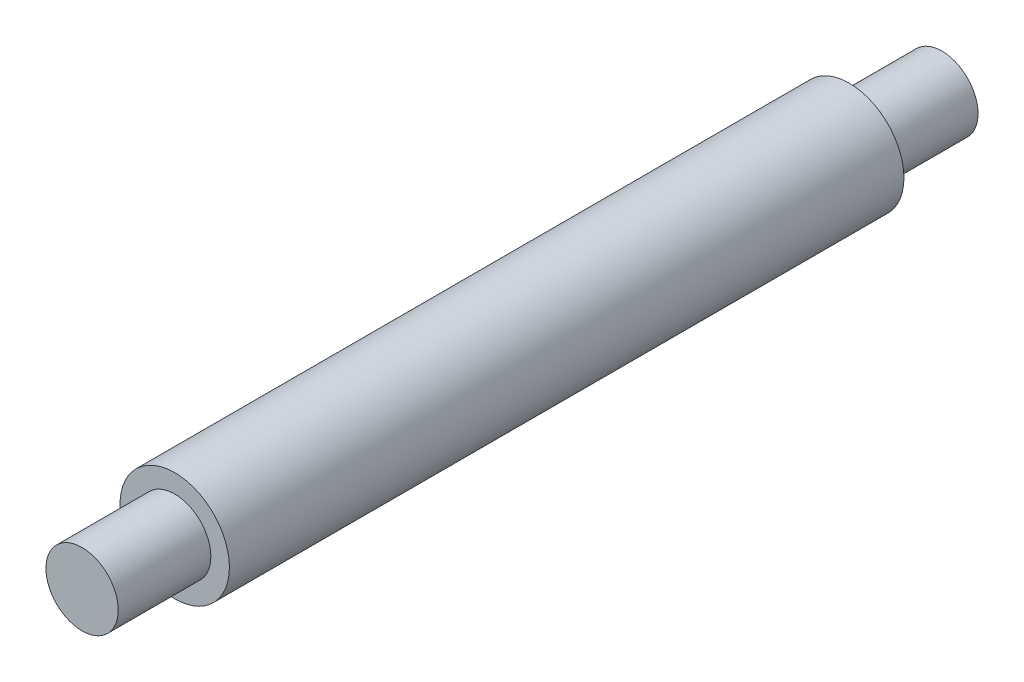
ISO-10303-21;
HEADER;
FILE_DESCRIPTION(('STEP AP214'),'2;1');
FILE_NAME('part.step','',(''),(''),'','','');
FILE_SCHEMA(('AUTOMOTIVE_DESIGN { 1 0 10303 214 1 1 1 1 }'));
ENDSEC;
DATA;
#1=APPLICATION_CONTEXT('core data for automotive mechanical design processes');
#2=APPLICATION_PROTOCOL_DEFINITION('international standard','automotive_design',2000,#1);
#3=PRODUCT_CONTEXT('',#1,'mechanical');
#4=PRODUCT('Part','Part','',(#3));
#5=PRODUCT_RELATED_PRODUCT_CATEGORY('part','',(#4));
#6=PRODUCT_DEFINITION_FORMATION('','',#4);
#7=PRODUCT_DEFINITION_CONTEXT('part definition',#1,'design');
#8=PRODUCT_DEFINITION('design','',#6,#7);
#9=PRODUCT_DEFINITION_SHAPE('','',#8);
#10=(LENGTH_UNIT() NAMED_UNIT(*) SI_UNIT(.MILLI.,.METRE.));
#11=(NAMED_UNIT(*) PLANE_ANGLE_UNIT() SI_UNIT($,.RADIAN.));
#12=(NAMED_UNIT(*) SI_UNIT($,.STERADIAN.) SOLID_ANGLE_UNIT());
#13=UNCERTAINTY_MEASURE_WITH_UNIT(LENGTH_MEASURE(1.E-05),#10,'distance_accuracy_value','');
#14=(GEOMETRIC_REPRESENTATION_CONTEXT(3) GLOBAL_UNCERTAINTY_ASSIGNED_CONTEXT((#13)) GLOBAL_UNIT_ASSIGNED_CONTEXT((#10,
#11,#12)) REPRESENTATION_CONTEXT('',''));
#15=CARTESIAN_POINT('',(0.,0.,0.));
#16=DIRECTION('',(0.,0.,1.));
#17=DIRECTION('',(1.,0.,0.));
#18=AXIS2_PLACEMENT_3D('',#15,#16,#17);
#19=CARTESIAN_POINT('',(0.,0.,36.4));
#20=DIRECTION('',(0.,0.,-1.));
#21=DIRECTION('',(-1.,0.,0.));
#22=AXIS2_PLACEMENT_3D('',#19,#20,#21);
#23=CYLINDRICAL_SURFACE('',#22,2.95);
#24=CARTESIAN_POINT('',(0.,0.,36.4));
#25=DIRECTION('',(0.,0.,1.));
#26=DIRECTION('',(1.,0.,0.));
#27=AXIS2_PLACEMENT_3D('',#24,#25,#26);
#28=CIRCLE('',#27,2.95);
#29=CARTESIAN_POINT('',(2.95,0.,36.4));
#30=VERTEX_POINT('',#29);
#31=EDGE_CURVE('E51',#30,#30,#28,.T.);
#32=ORIENTED_EDGE('',*,*,#31,.F.);
#33=EDGE_LOOP('',(#32));
#34=FACE_BOUND('',#33,.T.);
#35=CARTESIAN_POINT('',(0.,0.,0.));
#36=DIRECTION('',(0.,0.,1.));
#37=DIRECTION('',(1.,0.,0.));
#38=AXIS2_PLACEMENT_3D('',#35,#36,#37);
#39=CIRCLE('',#38,2.95);
#40=CARTESIAN_POINT('',(2.95,0.,0.));
#41=VERTEX_POINT('',#40);
#42=EDGE_CURVE('E40',#41,#41,#39,.T.);
#43=ORIENTED_EDGE('',*,*,#42,.T.);
#44=EDGE_LOOP('',(#43));
#45=FACE_BOUND('',#44,.T.);
#46=ADVANCED_FACE('F37',(#34,#45),#23,.T.);
#47=CARTESIAN_POINT('',(0.,0.,36.4));
#48=DIRECTION('',(0.,0.,1.));
#49=DIRECTION('',(1.,0.,0.));
#50=AXIS2_PLACEMENT_3D('',#47,#48,#49);
#51=PLANE('',#50);
#52=CARTESIAN_POINT('',(0.,0.,36.4));
#53=DIRECTION('',(0.,0.,1.));
#54=DIRECTION('',(1.,0.,0.));
#55=AXIS2_PLACEMENT_3D('',#52,#53,#54);
#56=CIRCLE('',#55,1.95);
#57=CARTESIAN_POINT('',(1.95,0.,36.4));
#58=VERTEX_POINT('',#57);
#59=EDGE_CURVE('E45',#58,#58,#56,.T.);
#60=ORIENTED_EDGE('',*,*,#59,.F.);
#61=EDGE_LOOP('',(#60));
#62=FACE_BOUND('',#61,.T.);
#63=ORIENTED_EDGE('',*,*,#31,.T.);
#64=EDGE_LOOP('',(#63));
#65=FACE_BOUND('',#64,.T.);
#66=ADVANCED_FACE('F71',(#62,#65),#51,.T.);
#67=CARTESIAN_POINT('',(0.,0.,0.));
#68=DIRECTION('',(0.,0.,1.));
#69=DIRECTION('',(1.,0.,0.));
#70=AXIS2_PLACEMENT_3D('',#67,#68,#69);
#71=PLANE('',#70);
#72=CARTESIAN_POINT('',(0.,0.,0.));
#73=DIRECTION('',(0.,0.,-1.));
#74=DIRECTION('',(-1.,0.,0.));
#75=AXIS2_PLACEMENT_3D('',#72,#73,#74);
#76=CIRCLE('',#75,1.95);
#77=CARTESIAN_POINT('',(-1.95,0.,0.));
#78=VERTEX_POINT('',#77);
#79=EDGE_CURVE('E10',#78,#78,#76,.T.);
#80=ORIENTED_EDGE('',*,*,#79,.F.);
#81=EDGE_LOOP('',(#80));
#82=FACE_BOUND('',#81,.T.);
#83=ORIENTED_EDGE('',*,*,#42,.F.);
#84=EDGE_LOOP('',(#83));
#85=FACE_BOUND('',#84,.T.);
#86=ADVANCED_FACE('F68',(#82,#85),#71,.F.);
#87=CARTESIAN_POINT('',(0.,0.,41.4));
#88=DIRECTION('',(0.,0.,-1.));
#89=DIRECTION('',(-1.,0.,0.));
#90=AXIS2_PLACEMENT_3D('',#87,#88,#89);
#91=CYLINDRICAL_SURFACE('',#90,1.95);
#92=CARTESIAN_POINT('',(0.,0.,41.4));
#93=DIRECTION('',(0.,0.,1.));
#94=DIRECTION('',(1.,0.,0.));
#95=AXIS2_PLACEMENT_3D('',#92,#93,#94);
#96=CIRCLE('',#95,1.95);
#97=CARTESIAN_POINT('',(1.95,0.,41.4));
#98=VERTEX_POINT('',#97);
#99=EDGE_CURVE('E56',#98,#98,#96,.T.);
#100=ORIENTED_EDGE('',*,*,#99,.F.);
#101=EDGE_LOOP('',(#100));
#102=FACE_BOUND('',#101,.T.);
#103=ORIENTED_EDGE('',*,*,#59,.T.);
#104=EDGE_LOOP('',(#103));
#105=FACE_BOUND('',#104,.T.);
#106=ADVANCED_FACE('F70',(#102,#105),#91,.T.);
#107=CARTESIAN_POINT('',(0.,0.,41.4));
#108=DIRECTION('',(0.,0.,1.));
#109=DIRECTION('',(1.,0.,0.));
#110=AXIS2_PLACEMENT_3D('',#107,#108,#109);
#111=PLANE('',#110);
#112=ORIENTED_EDGE('',*,*,#99,.T.);
#113=EDGE_LOOP('',(#112));
#114=FACE_BOUND('',#113,.T.);
#115=ADVANCED_FACE('F77',(#114),#111,.T.);
#116=CARTESIAN_POINT('',(0.,0.,-5.));
#117=DIRECTION('',(0.,0.,1.));
#118=DIRECTION('',(1.,0.,0.));
#119=AXIS2_PLACEMENT_3D('',#116,#117,#118);
#120=CYLINDRICAL_SURFACE('',#119,1.95);
#121=CARTESIAN_POINT('',(0.,0.,-5.));
#122=DIRECTION('',(0.,0.,-1.));
#123=DIRECTION('',(-1.,0.,0.));
#124=AXIS2_PLACEMENT_3D('',#121,#122,#123);
#125=CIRCLE('',#124,1.95);
#126=CARTESIAN_POINT('',(-1.95,0.,-5.));
#127=VERTEX_POINT('',#126);
#128=EDGE_CURVE('E55',#127,#127,#125,.T.);
#129=ORIENTED_EDGE('',*,*,#128,.F.);
#130=EDGE_LOOP('',(#129));
#131=FACE_BOUND('',#130,.T.);
#132=ORIENTED_EDGE('',*,*,#79,.T.);
#133=EDGE_LOOP('',(#132));
#134=FACE_BOUND('',#133,.T.);
#135=ADVANCED_FACE('F105',(#131,#134),#120,.T.);
#136=CARTESIAN_POINT('',(0.,0.,-5.));
#137=DIRECTION('',(0.,0.,-1.));
#138=DIRECTION('',(-1.,0.,0.));
#139=AXIS2_PLACEMENT_3D('',#136,#137,#138);
#140=PLANE('',#139);
#141=ORIENTED_EDGE('',*,*,#128,.T.);
#142=EDGE_LOOP('',(#141));
#143=FACE_BOUND('',#142,.T.);
#144=ADVANCED_FACE('F119',(#143),#140,.T.);
#145=CLOSED_SHELL('',(#46,#66,#86,#106,#115,#135,#144));
#146=MANIFOLD_SOLID_BREP('B2',#145);
#147=ADVANCED_BREP_SHAPE_REPRESENTATION('',(#18,#146),#14);
#148=SHAPE_DEFINITION_REPRESENTATION(#9,#147);
ENDSEC;
END-ISO-10303-21;
